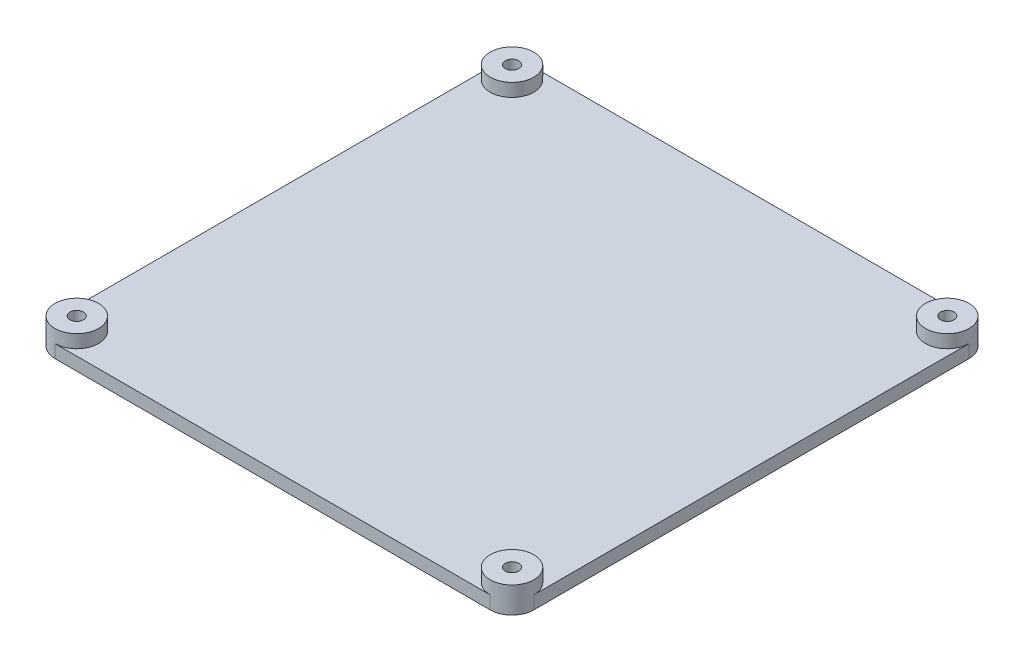
ISO-10303-21;
HEADER;
FILE_DESCRIPTION(('STEP AP214'),'2;1');
FILE_NAME('part.step','',(''),(''),'','','');
FILE_SCHEMA(('AUTOMOTIVE_DESIGN { 1 0 10303 214 1 1 1 1 }'));
ENDSEC;
DATA;
#1=APPLICATION_CONTEXT('core data for automotive mechanical design processes');
#2=APPLICATION_PROTOCOL_DEFINITION('international standard','automotive_design',2000,#1);
#3=PRODUCT_CONTEXT('',#1,'mechanical');
#4=PRODUCT('Part','Part','',(#3));
#5=PRODUCT_RELATED_PRODUCT_CATEGORY('part','',(#4));
#6=PRODUCT_DEFINITION_FORMATION('','',#4);
#7=PRODUCT_DEFINITION_CONTEXT('part definition',#1,'design');
#8=PRODUCT_DEFINITION('design','',#6,#7);
#9=PRODUCT_DEFINITION_SHAPE('','',#8);
#10=(LENGTH_UNIT() NAMED_UNIT(*) SI_UNIT(.MILLI.,.METRE.));
#11=(NAMED_UNIT(*) PLANE_ANGLE_UNIT() SI_UNIT($,.RADIAN.));
#12=(NAMED_UNIT(*) SI_UNIT($,.STERADIAN.) SOLID_ANGLE_UNIT());
#13=UNCERTAINTY_MEASURE_WITH_UNIT(LENGTH_MEASURE(1.E-05),#10,'distance_accuracy_value','');
#14=(GEOMETRIC_REPRESENTATION_CONTEXT(3) GLOBAL_UNCERTAINTY_ASSIGNED_CONTEXT((#13)) GLOBAL_UNIT_ASSIGNED_CONTEXT((#10,
#11,#12)) REPRESENTATION_CONTEXT('',''));
#15=CARTESIAN_POINT('',(0.,0.,0.));
#16=DIRECTION('',(0.,0.,1.));
#17=DIRECTION('',(1.,0.,0.));
#18=AXIS2_PLACEMENT_3D('',#15,#16,#17);
#19=CARTESIAN_POINT('',(0.,3.,0.));
#20=DIRECTION('',(0.,1.,0.));
#21=DIRECTION('',(0.,0.,1.));
#22=AXIS2_PLACEMENT_3D('',#19,#20,#21);
#23=PLANE('',#22);
#24=DIRECTION('',(0.,0.,1.));
#25=VECTOR('',#24,1.);
#26=CARTESIAN_POINT('',(-55.,3.,-55.));
#27=LINE('',#26,#25);
#28=CARTESIAN_POINT('',(-55.,3.,-50.));
#29=VERTEX_POINT('',#28);
#30=CARTESIAN_POINT('',(-55.,3.,50.));
#31=VERTEX_POINT('',#30);
#32=EDGE_CURVE('E119',#29,#31,#27,.T.);
#33=ORIENTED_EDGE('',*,*,#32,.T.);
#34=CARTESIAN_POINT('',(-50.,3.,50.));
#35=DIRECTION('',(0.,1.,0.));
#36=DIRECTION('',(0.,0.,1.));
#37=AXIS2_PLACEMENT_3D('',#34,#35,#36);
#38=CIRCLE('',#37,5.);
#39=CARTESIAN_POINT('',(-50.,3.,55.));
#40=VERTEX_POINT('',#39);
#41=EDGE_CURVE('E109',#40,#31,#38,.T.);
#42=ORIENTED_EDGE('',*,*,#41,.F.);
#43=DIRECTION('',(1.,0.,0.));
#44=VECTOR('',#43,1.);
#45=CARTESIAN_POINT('',(-55.,3.,55.));
#46=LINE('',#45,#44);
#47=CARTESIAN_POINT('',(50.,3.,55.));
#48=VERTEX_POINT('',#47);
#49=EDGE_CURVE('E113',#40,#48,#46,.T.);
#50=ORIENTED_EDGE('',*,*,#49,.T.);
#51=CARTESIAN_POINT('',(50.,3.,50.));
#52=DIRECTION('',(0.,1.,0.));
#53=DIRECTION('',(0.,0.,1.));
#54=AXIS2_PLACEMENT_3D('',#51,#52,#53);
#55=CIRCLE('',#54,4.99999999999999);
#56=CARTESIAN_POINT('',(55.,3.,50.));
#57=VERTEX_POINT('',#56);
#58=EDGE_CURVE('E127',#57,#48,#55,.T.);
#59=ORIENTED_EDGE('',*,*,#58,.F.);
#60=DIRECTION('',(0.,0.,1.));
#61=VECTOR('',#60,1.);
#62=CARTESIAN_POINT('',(55.,3.,-55.));
#63=LINE('',#62,#61);
#64=CARTESIAN_POINT('',(55.,3.,-50.));
#65=VERTEX_POINT('',#64);
#66=EDGE_CURVE('E118',#65,#57,#63,.T.);
#67=ORIENTED_EDGE('',*,*,#66,.F.);
#68=CARTESIAN_POINT('',(50.,3.,-50.));
#69=DIRECTION('',(0.,1.,0.));
#70=DIRECTION('',(0.,0.,1.));
#71=AXIS2_PLACEMENT_3D('',#68,#69,#70);
#72=CIRCLE('',#71,5.);
#73=CARTESIAN_POINT('',(50.,3.,-55.));
#74=VERTEX_POINT('',#73);
#75=EDGE_CURVE('E137',#74,#65,#72,.T.);
#76=ORIENTED_EDGE('',*,*,#75,.F.);
#77=DIRECTION('',(1.,0.,0.));
#78=VECTOR('',#77,1.);
#79=CARTESIAN_POINT('',(-55.,3.,-55.));
#80=LINE('',#79,#78);
#81=CARTESIAN_POINT('',(-50.,3.,-55.));
#82=VERTEX_POINT('',#81);
#83=EDGE_CURVE('E149',#82,#74,#80,.T.);
#84=ORIENTED_EDGE('',*,*,#83,.F.);
#85=CARTESIAN_POINT('',(-50.,3.,-50.));
#86=DIRECTION('',(0.,1.,0.));
#87=DIRECTION('',(0.,0.,1.));
#88=AXIS2_PLACEMENT_3D('',#85,#86,#87);
#89=CIRCLE('',#88,5.);
#90=EDGE_CURVE('E12',#29,#82,#89,.T.);
#91=ORIENTED_EDGE('',*,*,#90,.F.);
#92=EDGE_LOOP('',(#33,#42,#50,#59,#67,#76,#84,#91));
#93=FACE_BOUND('',#92,.T.);
#94=ADVANCED_FACE('F35',(#93),#23,.T.);
#95=CARTESIAN_POINT('',(-55.,3.,-55.));
#96=DIRECTION('',(1.,0.,0.));
#97=DIRECTION('',(0.,0.,-1.));
#98=AXIS2_PLACEMENT_3D('',#95,#96,#97);
#99=PLANE('',#98);
#100=ORIENTED_EDGE('',*,*,#32,.F.);
#101=DIRECTION('',(0.,-1.,0.));
#102=VECTOR('',#101,1.);
#103=CARTESIAN_POINT('',(-55.,0.,-50.));
#104=LINE('',#103,#102);
#105=CARTESIAN_POINT('',(-55.,0.,-50.));
#106=VERTEX_POINT('',#105);
#107=EDGE_CURVE('E162',#29,#106,#104,.T.);
#108=ORIENTED_EDGE('',*,*,#107,.T.);
#109=DIRECTION('',(0.,0.,1.));
#110=VECTOR('',#109,1.);
#111=CARTESIAN_POINT('',(-55.,0.,-55.));
#112=LINE('',#111,#110);
#113=CARTESIAN_POINT('',(-55.,0.,50.));
#114=VERTEX_POINT('',#113);
#115=EDGE_CURVE('E146',#106,#114,#112,.T.);
#116=ORIENTED_EDGE('',*,*,#115,.T.);
#117=DIRECTION('',(0.,-1.,0.));
#118=VECTOR('',#117,1.);
#119=CARTESIAN_POINT('',(-55.,3.,50.));
#120=LINE('',#119,#118);
#121=EDGE_CURVE('E160',#114,#31,#120,.F.);
#122=ORIENTED_EDGE('',*,*,#121,.T.);
#123=EDGE_LOOP('',(#100,#108,#116,#122));
#124=FACE_BOUND('',#123,.T.);
#125=ADVANCED_FACE('F192',(#124),#99,.F.);
#126=CARTESIAN_POINT('',(-55.,3.,55.));
#127=DIRECTION('',(0.,0.,-1.));
#128=DIRECTION('',(-1.,0.,0.));
#129=AXIS2_PLACEMENT_3D('',#126,#127,#128);
#130=PLANE('',#129);
#131=DIRECTION('',(1.,0.,0.));
#132=VECTOR('',#131,1.);
#133=CARTESIAN_POINT('',(-55.,0.,55.));
#134=LINE('',#133,#132);
#135=CARTESIAN_POINT('',(-50.,0.,55.));
#136=VERTEX_POINT('',#135);
#137=CARTESIAN_POINT('',(50.,0.,55.));
#138=VERTEX_POINT('',#137);
#139=EDGE_CURVE('E152',#136,#138,#134,.T.);
#140=ORIENTED_EDGE('',*,*,#139,.T.);
#141=DIRECTION('',(0.,-1.,0.));
#142=VECTOR('',#141,1.);
#143=CARTESIAN_POINT('',(50.,3.,55.));
#144=LINE('',#143,#142);
#145=EDGE_CURVE('E44',#138,#48,#144,.F.);
#146=ORIENTED_EDGE('',*,*,#145,.T.);
#147=ORIENTED_EDGE('',*,*,#49,.F.);
#148=DIRECTION('',(0.,-1.,0.));
#149=VECTOR('',#148,1.);
#150=CARTESIAN_POINT('',(-50.,3.,55.));
#151=LINE('',#150,#149);
#152=EDGE_CURVE('E105',#40,#136,#151,.T.);
#153=ORIENTED_EDGE('',*,*,#152,.T.);
#154=EDGE_LOOP('',(#140,#146,#147,#153));
#155=FACE_BOUND('',#154,.T.);
#156=ADVANCED_FACE('F114',(#155),#130,.F.);
#157=CARTESIAN_POINT('',(55.,3.,-55.));
#158=DIRECTION('',(1.,0.,0.));
#159=DIRECTION('',(0.,0.,-1.));
#160=AXIS2_PLACEMENT_3D('',#157,#158,#159);
#161=PLANE('',#160);
#162=DIRECTION('',(0.,0.,1.));
#163=VECTOR('',#162,1.);
#164=CARTESIAN_POINT('',(55.,0.,-55.));
#165=LINE('',#164,#163);
#166=CARTESIAN_POINT('',(55.,0.,-50.));
#167=VERTEX_POINT('',#166);
#168=CARTESIAN_POINT('',(55.,0.,50.));
#169=VERTEX_POINT('',#168);
#170=EDGE_CURVE('E154',#167,#169,#165,.T.);
#171=ORIENTED_EDGE('',*,*,#170,.F.);
#172=DIRECTION('',(0.,-1.,0.));
#173=VECTOR('',#172,1.);
#174=CARTESIAN_POINT('',(55.,3.,-50.));
#175=LINE('',#174,#173);
#176=EDGE_CURVE('E52',#167,#65,#175,.F.);
#177=ORIENTED_EDGE('',*,*,#176,.T.);
#178=ORIENTED_EDGE('',*,*,#66,.T.);
#179=DIRECTION('',(0.,-1.,0.));
#180=VECTOR('',#179,1.);
#181=CARTESIAN_POINT('',(55.,0.,50.));
#182=LINE('',#181,#180);
#183=EDGE_CURVE('E174',#57,#169,#182,.T.);
#184=ORIENTED_EDGE('',*,*,#183,.T.);
#185=EDGE_LOOP('',(#171,#177,#178,#184));
#186=FACE_BOUND('',#185,.T.);
#187=ADVANCED_FACE('F241',(#186),#161,.T.);
#188=CARTESIAN_POINT('',(-55.,3.,-55.));
#189=DIRECTION('',(0.,0.,-1.));
#190=DIRECTION('',(-1.,0.,0.));
#191=AXIS2_PLACEMENT_3D('',#188,#189,#190);
#192=PLANE('',#191);
#193=DIRECTION('',(1.,0.,0.));
#194=VECTOR('',#193,1.);
#195=CARTESIAN_POINT('',(-55.,0.,-55.));
#196=LINE('',#195,#194);
#197=CARTESIAN_POINT('',(-50.,0.,-55.));
#198=VERTEX_POINT('',#197);
#199=CARTESIAN_POINT('',(50.,0.,-55.));
#200=VERTEX_POINT('',#199);
#201=EDGE_CURVE('E157',#198,#200,#196,.T.);
#202=ORIENTED_EDGE('',*,*,#201,.F.);
#203=DIRECTION('',(0.,-1.,0.));
#204=VECTOR('',#203,1.);
#205=CARTESIAN_POINT('',(-50.,3.,-55.));
#206=LINE('',#205,#204);
#207=EDGE_CURVE('E173',#198,#82,#206,.F.);
#208=ORIENTED_EDGE('',*,*,#207,.T.);
#209=ORIENTED_EDGE('',*,*,#83,.T.);
#210=DIRECTION('',(0.,-1.,0.));
#211=VECTOR('',#210,1.);
#212=CARTESIAN_POINT('',(50.,3.,-55.));
#213=LINE('',#212,#211);
#214=EDGE_CURVE('E170',#74,#200,#213,.T.);
#215=ORIENTED_EDGE('',*,*,#214,.T.);
#216=EDGE_LOOP('',(#202,#208,#209,#215));
#217=FACE_BOUND('',#216,.T.);
#218=ADVANCED_FACE('F207',(#217),#192,.T.);
#219=CARTESIAN_POINT('',(0.,0.,0.));
#220=DIRECTION('',(0.,1.,0.));
#221=DIRECTION('',(0.,0.,1.));
#222=AXIS2_PLACEMENT_3D('',#219,#220,#221);
#223=PLANE('',#222);
#224=CARTESIAN_POINT('',(-50.,0.,-50.));
#225=DIRECTION('',(0.,-1.,0.));
#226=DIRECTION('',(0.,0.,-1.));
#227=AXIS2_PLACEMENT_3D('',#224,#225,#226);
#228=CIRCLE('',#227,1.55);
#229=CARTESIAN_POINT('',(-50.,0.,-51.55));
#230=VERTEX_POINT('',#229);
#231=EDGE_CURVE('E343',#230,#230,#228,.T.);
#232=ORIENTED_EDGE('',*,*,#231,.F.);
#233=EDGE_LOOP('',(#232));
#234=FACE_BOUND('',#233,.T.);
#235=CARTESIAN_POINT('',(50.,0.,50.));
#236=DIRECTION('',(0.,-1.,0.));
#237=DIRECTION('',(0.,0.,-1.));
#238=AXIS2_PLACEMENT_3D('',#235,#236,#237);
#239=CIRCLE('',#238,1.55);
#240=CARTESIAN_POINT('',(50.,0.,48.45));
#241=VERTEX_POINT('',#240);
#242=EDGE_CURVE('E345',#241,#241,#239,.T.);
#243=ORIENTED_EDGE('',*,*,#242,.F.);
#244=EDGE_LOOP('',(#243));
#245=FACE_BOUND('',#244,.T.);
#246=CARTESIAN_POINT('',(50.,0.,-50.));
#247=DIRECTION('',(0.,-1.,0.));
#248=DIRECTION('',(0.,0.,-1.));
#249=AXIS2_PLACEMENT_3D('',#246,#247,#248);
#250=CIRCLE('',#249,1.55);
#251=CARTESIAN_POINT('',(50.,0.,-51.55));
#252=VERTEX_POINT('',#251);
#253=EDGE_CURVE('E352',#252,#252,#250,.T.);
#254=ORIENTED_EDGE('',*,*,#253,.F.);
#255=EDGE_LOOP('',(#254));
#256=FACE_BOUND('',#255,.T.);
#257=CARTESIAN_POINT('',(-50.,0.,50.));
#258=DIRECTION('',(0.,-1.,0.));
#259=DIRECTION('',(0.,0.,-1.));
#260=AXIS2_PLACEMENT_3D('',#257,#258,#259);
#261=CIRCLE('',#260,1.55);
#262=CARTESIAN_POINT('',(-50.,0.,48.45));
#263=VERTEX_POINT('',#262);
#264=EDGE_CURVE('E130',#263,#263,#261,.T.);
#265=ORIENTED_EDGE('',*,*,#264,.F.);
#266=EDGE_LOOP('',(#265));
#267=FACE_BOUND('',#266,.T.);
#268=ORIENTED_EDGE('',*,*,#115,.F.);
#269=CARTESIAN_POINT('',(-50.,0.,-50.));
#270=DIRECTION('',(0.,1.,0.));
#271=DIRECTION('',(0.,0.,1.));
#272=AXIS2_PLACEMENT_3D('',#269,#270,#271);
#273=CIRCLE('',#272,5.);
#274=EDGE_CURVE('E168',#106,#198,#273,.F.);
#275=ORIENTED_EDGE('',*,*,#274,.T.);
#276=ORIENTED_EDGE('',*,*,#201,.T.);
#277=CARTESIAN_POINT('',(50.,0.,-50.));
#278=DIRECTION('',(0.,1.,0.));
#279=DIRECTION('',(0.,0.,1.));
#280=AXIS2_PLACEMENT_3D('',#277,#278,#279);
#281=CIRCLE('',#280,5.);
#282=EDGE_CURVE('E166',#200,#167,#281,.F.);
#283=ORIENTED_EDGE('',*,*,#282,.T.);
#284=ORIENTED_EDGE('',*,*,#170,.T.);
#285=CARTESIAN_POINT('',(50.,0.,50.));
#286=DIRECTION('',(0.,1.,0.));
#287=DIRECTION('',(0.,0.,1.));
#288=AXIS2_PLACEMENT_3D('',#285,#286,#287);
#289=CIRCLE('',#288,5.);
#290=EDGE_CURVE('E164',#169,#138,#289,.F.);
#291=ORIENTED_EDGE('',*,*,#290,.T.);
#292=ORIENTED_EDGE('',*,*,#139,.F.);
#293=CARTESIAN_POINT('',(-50.,0.,50.));
#294=DIRECTION('',(0.,1.,0.));
#295=DIRECTION('',(0.,0.,1.));
#296=AXIS2_PLACEMENT_3D('',#293,#294,#295);
#297=CIRCLE('',#296,5.);
#298=EDGE_CURVE('E110',#136,#114,#297,.F.);
#299=ORIENTED_EDGE('',*,*,#298,.T.);
#300=EDGE_LOOP('',(#268,#275,#276,#283,#284,#291,#292,#299));
#301=FACE_BOUND('',#300,.T.);
#302=ADVANCED_FACE('F195',(#234,#245,#256,#267,#301),#223,.F.);
#303=CARTESIAN_POINT('',(-50.,3.,-50.));
#304=DIRECTION('',(0.,1.,0.));
#305=DIRECTION('',(0.,0.,1.));
#306=AXIS2_PLACEMENT_3D('',#303,#304,#305);
#307=CYLINDRICAL_SURFACE('',#306,5.);
#308=ORIENTED_EDGE('',*,*,#107,.F.);
#309=ORIENTED_EDGE('',*,*,#90,.T.);
#310=ORIENTED_EDGE('',*,*,#207,.F.);
#311=ORIENTED_EDGE('',*,*,#274,.F.);
#312=EDGE_LOOP('',(#308,#309,#310,#311));
#313=FACE_BOUND('',#312,.T.);
#314=CARTESIAN_POINT('',(-50.,6.,-50.));
#315=DIRECTION('',(0.,1.,0.));
#316=DIRECTION('',(0.,0.,1.));
#317=AXIS2_PLACEMENT_3D('',#314,#315,#316);
#318=CIRCLE('',#317,5.);
#319=CARTESIAN_POINT('',(-50.,6.,-45.));
#320=VERTEX_POINT('',#319);
#321=EDGE_CURVE('E142',#320,#320,#318,.T.);
#322=ORIENTED_EDGE('',*,*,#321,.F.);
#323=EDGE_LOOP('',(#322));
#324=FACE_BOUND('',#323,.T.);
#325=ADVANCED_FACE('F209',(#313,#324),#307,.T.);
#326=CARTESIAN_POINT('',(50.,3.,-50.));
#327=DIRECTION('',(0.,-1.,0.));
#328=DIRECTION('',(0.,0.,-1.));
#329=AXIS2_PLACEMENT_3D('',#326,#327,#328);
#330=CYLINDRICAL_SURFACE('',#329,5.);
#331=ORIENTED_EDGE('',*,*,#214,.F.);
#332=ORIENTED_EDGE('',*,*,#75,.T.);
#333=ORIENTED_EDGE('',*,*,#176,.F.);
#334=ORIENTED_EDGE('',*,*,#282,.F.);
#335=EDGE_LOOP('',(#331,#332,#333,#334));
#336=FACE_BOUND('',#335,.T.);
#337=CARTESIAN_POINT('',(50.,6.,-50.));
#338=DIRECTION('',(0.,1.,0.));
#339=DIRECTION('',(0.,0.,1.));
#340=AXIS2_PLACEMENT_3D('',#337,#338,#339);
#341=CIRCLE('',#340,5.);
#342=CARTESIAN_POINT('',(50.,6.,-45.));
#343=VERTEX_POINT('',#342);
#344=EDGE_CURVE('E139',#343,#343,#341,.T.);
#345=ORIENTED_EDGE('',*,*,#344,.F.);
#346=EDGE_LOOP('',(#345));
#347=FACE_BOUND('',#346,.T.);
#348=ADVANCED_FACE('F202',(#336,#347),#330,.T.);
#349=CARTESIAN_POINT('',(50.,3.,50.));
#350=DIRECTION('',(0.,1.,0.));
#351=DIRECTION('',(0.,0.,1.));
#352=AXIS2_PLACEMENT_3D('',#349,#350,#351);
#353=CYLINDRICAL_SURFACE('',#352,5.);
#354=ORIENTED_EDGE('',*,*,#183,.F.);
#355=ORIENTED_EDGE('',*,*,#58,.T.);
#356=ORIENTED_EDGE('',*,*,#145,.F.);
#357=ORIENTED_EDGE('',*,*,#290,.F.);
#358=EDGE_LOOP('',(#354,#355,#356,#357));
#359=FACE_BOUND('',#358,.T.);
#360=CARTESIAN_POINT('',(50.,6.,50.));
#361=DIRECTION('',(0.,1.,0.));
#362=DIRECTION('',(0.,0.,1.));
#363=AXIS2_PLACEMENT_3D('',#360,#361,#362);
#364=CIRCLE('',#363,4.99999999999999);
#365=CARTESIAN_POINT('',(50.,6.,55.));
#366=VERTEX_POINT('',#365);
#367=EDGE_CURVE('E134',#366,#366,#364,.T.);
#368=ORIENTED_EDGE('',*,*,#367,.F.);
#369=EDGE_LOOP('',(#368));
#370=FACE_BOUND('',#369,.T.);
#371=ADVANCED_FACE('F198',(#359,#370),#353,.T.);
#372=CARTESIAN_POINT('',(-50.,3.,50.));
#373=DIRECTION('',(0.,-1.,0.));
#374=DIRECTION('',(0.,0.,-1.));
#375=AXIS2_PLACEMENT_3D('',#372,#373,#374);
#376=CYLINDRICAL_SURFACE('',#375,5.);
#377=ORIENTED_EDGE('',*,*,#152,.F.);
#378=ORIENTED_EDGE('',*,*,#41,.T.);
#379=ORIENTED_EDGE('',*,*,#121,.F.);
#380=ORIENTED_EDGE('',*,*,#298,.F.);
#381=EDGE_LOOP('',(#377,#378,#379,#380));
#382=FACE_BOUND('',#381,.T.);
#383=CARTESIAN_POINT('',(-50.,6.,50.));
#384=DIRECTION('',(0.,1.,0.));
#385=DIRECTION('',(0.,0.,1.));
#386=AXIS2_PLACEMENT_3D('',#383,#384,#385);
#387=CIRCLE('',#386,5.);
#388=CARTESIAN_POINT('',(-50.,6.,55.));
#389=VERTEX_POINT('',#388);
#390=EDGE_CURVE('E123',#389,#389,#387,.T.);
#391=ORIENTED_EDGE('',*,*,#390,.F.);
#392=EDGE_LOOP('',(#391));
#393=FACE_BOUND('',#392,.T.);
#394=ADVANCED_FACE('F37',(#382,#393),#376,.T.);
#395=CARTESIAN_POINT('',(-50.,6.,-50.));
#396=DIRECTION('',(0.,1.,0.));
#397=DIRECTION('',(0.,0.,1.));
#398=AXIS2_PLACEMENT_3D('',#395,#396,#397);
#399=PLANE('',#398);
#400=CARTESIAN_POINT('',(-50.,6.,-50.));
#401=DIRECTION('',(0.,-1.,0.));
#402=DIRECTION('',(0.,0.,-1.));
#403=AXIS2_PLACEMENT_3D('',#400,#401,#402);
#404=CIRCLE('',#403,1.55);
#405=CARTESIAN_POINT('',(-50.,6.,-51.55));
#406=VERTEX_POINT('',#405);
#407=EDGE_CURVE('E340',#406,#406,#404,.T.);
#408=ORIENTED_EDGE('',*,*,#407,.T.);
#409=EDGE_LOOP('',(#408));
#410=FACE_BOUND('',#409,.T.);
#411=ORIENTED_EDGE('',*,*,#321,.T.);
#412=EDGE_LOOP('',(#411));
#413=FACE_BOUND('',#412,.T.);
#414=ADVANCED_FACE('F216',(#410,#413),#399,.T.);
#415=CARTESIAN_POINT('',(50.,6.,-50.));
#416=DIRECTION('',(0.,1.,0.));
#417=DIRECTION('',(0.,0.,1.));
#418=AXIS2_PLACEMENT_3D('',#415,#416,#417);
#419=PLANE('',#418);
#420=CARTESIAN_POINT('',(50.,6.,-50.));
#421=DIRECTION('',(0.,-1.,0.));
#422=DIRECTION('',(0.,0.,-1.));
#423=AXIS2_PLACEMENT_3D('',#420,#421,#422);
#424=CIRCLE('',#423,1.55);
#425=CARTESIAN_POINT('',(50.,6.,-51.55));
#426=VERTEX_POINT('',#425);
#427=EDGE_CURVE('E355',#426,#426,#424,.T.);
#428=ORIENTED_EDGE('',*,*,#427,.T.);
#429=EDGE_LOOP('',(#428));
#430=FACE_BOUND('',#429,.T.);
#431=ORIENTED_EDGE('',*,*,#344,.T.);
#432=EDGE_LOOP('',(#431));
#433=FACE_BOUND('',#432,.T.);
#434=ADVANCED_FACE('F218',(#430,#433),#419,.T.);
#435=CARTESIAN_POINT('',(50.,6.,50.));
#436=DIRECTION('',(0.,1.,0.));
#437=DIRECTION('',(0.,0.,1.));
#438=AXIS2_PLACEMENT_3D('',#435,#436,#437);
#439=PLANE('',#438);
#440=CARTESIAN_POINT('',(50.,6.,50.));
#441=DIRECTION('',(0.,-1.,0.));
#442=DIRECTION('',(0.,0.,-1.));
#443=AXIS2_PLACEMENT_3D('',#440,#441,#442);
#444=CIRCLE('',#443,1.55);
#445=CARTESIAN_POINT('',(50.,6.,48.45));
#446=VERTEX_POINT('',#445);
#447=EDGE_CURVE('E349',#446,#446,#444,.T.);
#448=ORIENTED_EDGE('',*,*,#447,.T.);
#449=EDGE_LOOP('',(#448));
#450=FACE_BOUND('',#449,.T.);
#451=ORIENTED_EDGE('',*,*,#367,.T.);
#452=EDGE_LOOP('',(#451));
#453=FACE_BOUND('',#452,.T.);
#454=ADVANCED_FACE('F225',(#450,#453),#439,.T.);
#455=CARTESIAN_POINT('',(-50.,6.,50.));
#456=DIRECTION('',(0.,1.,0.));
#457=DIRECTION('',(0.,0.,1.));
#458=AXIS2_PLACEMENT_3D('',#455,#456,#457);
#459=PLANE('',#458);
#460=CARTESIAN_POINT('',(-50.,6.,50.));
#461=DIRECTION('',(0.,-1.,0.));
#462=DIRECTION('',(0.,0.,-1.));
#463=AXIS2_PLACEMENT_3D('',#460,#461,#462);
#464=CIRCLE('',#463,1.55);
#465=CARTESIAN_POINT('',(-50.,6.,48.45));
#466=VERTEX_POINT('',#465);
#467=EDGE_CURVE('E124',#466,#466,#464,.T.);
#468=ORIENTED_EDGE('',*,*,#467,.T.);
#469=EDGE_LOOP('',(#468));
#470=FACE_BOUND('',#469,.T.);
#471=ORIENTED_EDGE('',*,*,#390,.T.);
#472=EDGE_LOOP('',(#471));
#473=FACE_BOUND('',#472,.T.);
#474=ADVANCED_FACE('F284',(#470,#473),#459,.T.);
#475=CARTESIAN_POINT('',(-50.,6.,50.));
#476=DIRECTION('',(0.,-1.,0.));
#477=DIRECTION('',(0.,0.,-1.));
#478=AXIS2_PLACEMENT_3D('',#475,#476,#477);
#479=CYLINDRICAL_SURFACE('',#478,1.55);
#480=ORIENTED_EDGE('',*,*,#467,.F.);
#481=EDGE_LOOP('',(#480));
#482=FACE_BOUND('',#481,.T.);
#483=ORIENTED_EDGE('',*,*,#264,.T.);
#484=EDGE_LOOP('',(#483));
#485=FACE_BOUND('',#484,.T.);
#486=ADVANCED_FACE('F294',(#482,#485),#479,.F.);
#487=CARTESIAN_POINT('',(50.,6.,-50.));
#488=DIRECTION('',(0.,-1.,0.));
#489=DIRECTION('',(0.,0.,-1.));
#490=AXIS2_PLACEMENT_3D('',#487,#488,#489);
#491=CYLINDRICAL_SURFACE('',#490,1.55);
#492=ORIENTED_EDGE('',*,*,#427,.F.);
#493=EDGE_LOOP('',(#492));
#494=FACE_BOUND('',#493,.T.);
#495=ORIENTED_EDGE('',*,*,#253,.T.);
#496=EDGE_LOOP('',(#495));
#497=FACE_BOUND('',#496,.T.);
#498=ADVANCED_FACE('F304',(#494,#497),#491,.F.);
#499=CARTESIAN_POINT('',(50.,6.,50.));
#500=DIRECTION('',(0.,-1.,0.));
#501=DIRECTION('',(0.,0.,-1.));
#502=AXIS2_PLACEMENT_3D('',#499,#500,#501);
#503=CYLINDRICAL_SURFACE('',#502,1.55);
#504=ORIENTED_EDGE('',*,*,#447,.F.);
#505=EDGE_LOOP('',(#504));
#506=FACE_BOUND('',#505,.T.);
#507=ORIENTED_EDGE('',*,*,#242,.T.);
#508=EDGE_LOOP('',(#507));
#509=FACE_BOUND('',#508,.T.);
#510=ADVANCED_FACE('F314',(#506,#509),#503,.F.);
#511=CARTESIAN_POINT('',(-50.,6.,-50.));
#512=DIRECTION('',(0.,-1.,0.));
#513=DIRECTION('',(0.,0.,-1.));
#514=AXIS2_PLACEMENT_3D('',#511,#512,#513);
#515=CYLINDRICAL_SURFACE('',#514,1.55);
#516=ORIENTED_EDGE('',*,*,#407,.F.);
#517=EDGE_LOOP('',(#516));
#518=FACE_BOUND('',#517,.T.);
#519=ORIENTED_EDGE('',*,*,#231,.T.);
#520=EDGE_LOOP('',(#519));
#521=FACE_BOUND('',#520,.T.);
#522=ADVANCED_FACE('F324',(#518,#521),#515,.F.);
#523=CLOSED_SHELL('',(#94,#125,#156,#187,#218,#302,#325,#348,#371,#394,#414,#434,#454,#474,#486,
#498,#510,#522));
#524=MANIFOLD_SOLID_BREP('B2',#523);
#525=ADVANCED_BREP_SHAPE_REPRESENTATION('',(#18,#524),#14);
#526=SHAPE_DEFINITION_REPRESENTATION(#9,#525);
ENDSEC;
END-ISO-10303-21;
